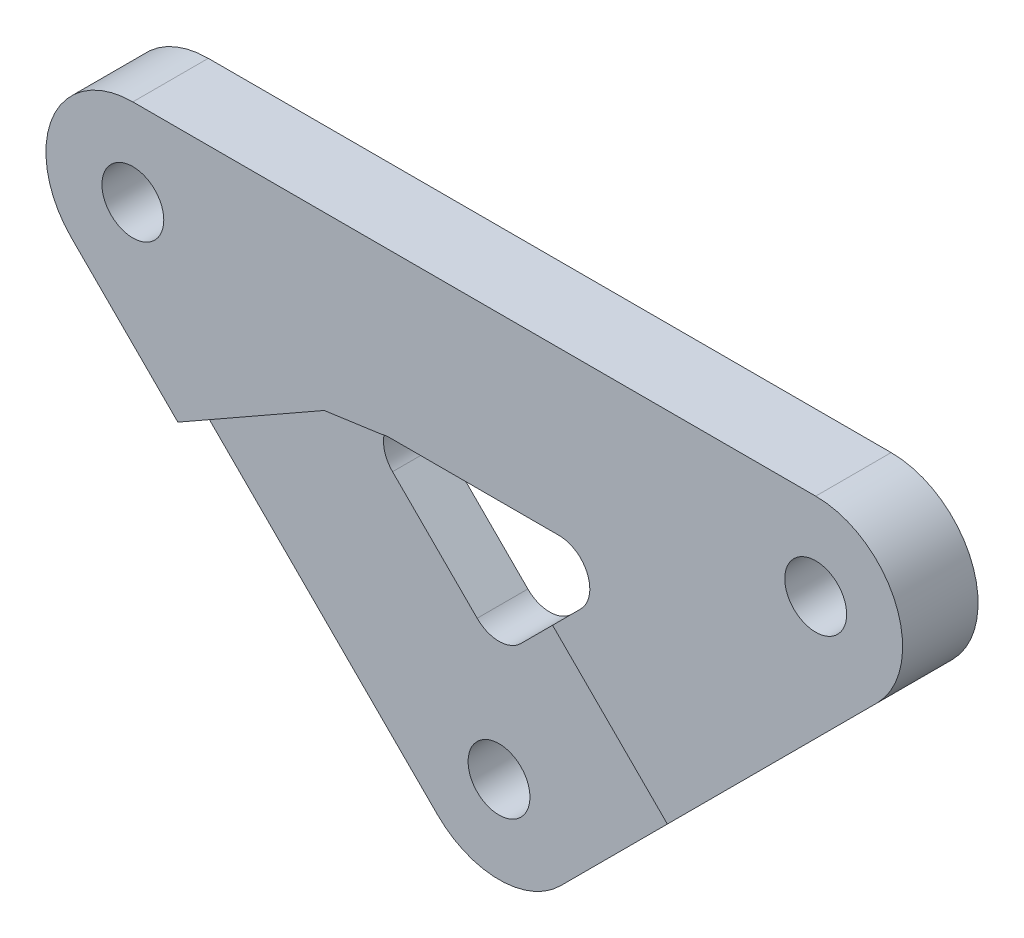
ISO-10303-21;
HEADER;
FILE_DESCRIPTION(('STEP AP214'),'2;1');
FILE_NAME('part.step','',(''),(''),'','','');
FILE_SCHEMA(('AUTOMOTIVE_DESIGN { 1 0 10303 214 1 1 1 1 }'));
ENDSEC;
DATA;
#1=APPLICATION_CONTEXT('core data for automotive mechanical design processes');
#2=APPLICATION_PROTOCOL_DEFINITION('international standard','automotive_design',2000,#1);
#3=PRODUCT_CONTEXT('',#1,'mechanical');
#4=PRODUCT('Part','Part','',(#3));
#5=PRODUCT_RELATED_PRODUCT_CATEGORY('part','',(#4));
#6=PRODUCT_DEFINITION_FORMATION('','',#4);
#7=PRODUCT_DEFINITION_CONTEXT('part definition',#1,'design');
#8=PRODUCT_DEFINITION('design','',#6,#7);
#9=PRODUCT_DEFINITION_SHAPE('','',#8);
#10=(LENGTH_UNIT() NAMED_UNIT(*) SI_UNIT(.MILLI.,.METRE.));
#11=(NAMED_UNIT(*) PLANE_ANGLE_UNIT() SI_UNIT($,.RADIAN.));
#12=(NAMED_UNIT(*) SI_UNIT($,.STERADIAN.) SOLID_ANGLE_UNIT());
#13=UNCERTAINTY_MEASURE_WITH_UNIT(LENGTH_MEASURE(1.E-05),#10,'distance_accuracy_value','');
#14=(GEOMETRIC_REPRESENTATION_CONTEXT(3) GLOBAL_UNCERTAINTY_ASSIGNED_CONTEXT((#13)) GLOBAL_UNIT_ASSIGNED_CONTEXT((#10,
#11,#12)) REPRESENTATION_CONTEXT('',''));
#15=CARTESIAN_POINT('',(0.,0.,0.));
#16=DIRECTION('',(0.,0.,1.));
#17=DIRECTION('',(1.,0.,0.));
#18=AXIS2_PLACEMENT_3D('',#15,#16,#17);
#19=CARTESIAN_POINT('',(0.,0.,5.));
#20=DIRECTION('',(0.,0.,1.));
#21=DIRECTION('',(1.,0.,0.));
#22=AXIS2_PLACEMENT_3D('',#19,#20,#21);
#23=PLANE('',#22);
#24=DIRECTION('',(-0.707106781186548,0.707106781186547,0.));
#25=VECTOR('',#24,1.);
#26=CARTESIAN_POINT('',(5.18840179831688,12.2594696101824,5.));
#27=LINE('',#26,#25);
#28=CARTESIAN_POINT('',(12.7972664676805,4.65060494081874,5.));
#29=VERTEX_POINT('',#28);
#30=CARTESIAN_POINT('',(5.18840179831688,12.2594696101824,5.));
#31=VERTEX_POINT('',#30);
#32=EDGE_CURVE('E162',#29,#31,#27,.T.);
#33=ORIENTED_EDGE('',*,*,#32,.F.);
#34=DIRECTION('',(0.707106781186547,0.707106781186547,0.));
#35=VECTOR('',#34,1.);
#36=CARTESIAN_POINT('',(4.07333076343086,-4.07333076343089,5.));
#37=LINE('',#36,#35);
#38=CARTESIAN_POINT('',(26.7007477614004,18.5540862345386,5.));
#39=VERTEX_POINT('',#38);
#40=EDGE_CURVE('E261',#29,#39,#37,.T.);
#41=ORIENTED_EDGE('',*,*,#40,.T.);
#42=CARTESIAN_POINT('',(22.6274169979695,22.6274169979695,5.));
#43=DIRECTION('',(0.,0.,1.));
#44=DIRECTION('',(-1.,0.,0.));
#45=AXIS2_PLACEMENT_3D('',#42,#43,#44);
#46=CIRCLE('',#45,5.7605596096755);
#47=CARTESIAN_POINT('',(22.6274169979695,28.387976607645,5.));
#48=VERTEX_POINT('',#47);
#49=EDGE_CURVE('E263',#39,#48,#46,.T.);
#50=ORIENTED_EDGE('',*,*,#49,.T.);
#51=DIRECTION('',(-1.,0.,0.));
#52=VECTOR('',#51,1.);
#53=CARTESIAN_POINT('',(22.6274169979695,28.387976607645,5.));
#54=LINE('',#53,#52);
#55=CARTESIAN_POINT('',(-22.6274169979695,28.387976607645,5.));
#56=VERTEX_POINT('',#55);
#57=EDGE_CURVE('E266',#48,#56,#54,.T.);
#58=ORIENTED_EDGE('',*,*,#57,.T.);
#59=CARTESIAN_POINT('',(-22.6274169979695,22.6274169979695,5.));
#60=DIRECTION('',(0.,0.,1.));
#61=DIRECTION('',(-1.,0.,0.));
#62=AXIS2_PLACEMENT_3D('',#59,#60,#61);
#63=CIRCLE('',#62,5.7605596096755);
#64=CARTESIAN_POINT('',(-26.7007477614004,18.5540862345386,5.));
#65=VERTEX_POINT('',#64);
#66=EDGE_CURVE('E268',#56,#65,#63,.T.);
#67=ORIENTED_EDGE('',*,*,#66,.T.);
#68=DIRECTION('',(0.707106781186548,-0.707106781186547,0.));
#69=VECTOR('',#68,1.);
#70=CARTESIAN_POINT('',(-26.7007477614004,18.5540862345386,5.));
#71=LINE('',#70,#69);
#72=CARTESIAN_POINT('',(-19.6438151370129,11.4971536101511,5.));
#73=VERTEX_POINT('',#72);
#74=EDGE_CURVE('E270',#65,#73,#71,.T.);
#75=ORIENTED_EDGE('',*,*,#74,.T.);
#76=DIRECTION('',(-0.869059872634388,-0.49470692109238,0.));
#77=VECTOR('',#76,1.);
#78=CARTESIAN_POINT('',(-19.6438151370129,11.4971536101511,5.));
#79=LINE('',#78,#77);
#80=CARTESIAN_POINT('',(-9.94632288120085,17.0173906930663,5.));
#81=VERTEX_POINT('',#80);
#82=EDGE_CURVE('E172',#81,#73,#79,.T.);
#83=ORIENTED_EDGE('',*,*,#82,.F.);
#84=DIRECTION('',(-0.990261652823926,-0.139218744953497,0.));
#85=VECTOR('',#84,1.);
#86=CARTESIAN_POINT('',(-9.94632288120085,17.0173906930663,5.));
#87=LINE('',#86,#85);
#88=CARTESIAN_POINT('',(-6.17244961961426,17.5479513762892,5.));
#89=VERTEX_POINT('',#88);
#90=EDGE_CURVE('E189',#89,#81,#87,.T.);
#91=ORIENTED_EDGE('',*,*,#90,.F.);
#92=CARTESIAN_POINT('',(-5.6072113832392,15.5774169979695,5.));
#93=DIRECTION('',(0.,0.,1.));
#94=DIRECTION('',(1.,0.,0.));
#95=AXIS2_PLACEMENT_3D('',#92,#93,#94);
#96=CIRCLE('',#95,2.05);
#97=CARTESIAN_POINT('',(-5.6072113832392,17.6274169979695,5.));
#98=VERTEX_POINT('',#97);
#99=EDGE_CURVE('E228',#98,#89,#96,.T.);
#100=ORIENTED_EDGE('',*,*,#99,.F.);
#101=DIRECTION('',(-1.,0.,0.));
#102=VECTOR('',#101,1.);
#103=CARTESIAN_POINT('',(5.6072113832392,17.6274169979695,5.));
#104=LINE('',#103,#102);
#105=CARTESIAN_POINT('',(5.6072113832392,17.6274169979695,5.));
#106=VERTEX_POINT('',#105);
#107=EDGE_CURVE('E226',#106,#98,#104,.T.);
#108=ORIENTED_EDGE('',*,*,#107,.F.);
#109=CARTESIAN_POINT('',(5.6072113832392,15.5774169979695,5.));
#110=DIRECTION('',(0.,0.,1.));
#111=DIRECTION('',(-1.,0.,0.));
#112=AXIS2_PLACEMENT_3D('',#109,#110,#111);
#113=CIRCLE('',#112,2.05);
#114=CARTESIAN_POINT('',(7.05678028467162,14.1278480965371,5.));
#115=VERTEX_POINT('',#114);
#116=EDGE_CURVE('E223',#115,#106,#113,.T.);
#117=ORIENTED_EDGE('',*,*,#116,.F.);
#118=DIRECTION('',(0.707106781186547,0.707106781186548,0.));
#119=VECTOR('',#118,1.);
#120=CARTESIAN_POINT('',(1.44956890143242,8.5206367132979,5.));
#121=LINE('',#120,#119);
#122=EDGE_CURVE('E221',#31,#115,#121,.T.);
#123=ORIENTED_EDGE('',*,*,#122,.F.);
#124=EDGE_LOOP('',(#33,#41,#50,#58,#67,#75,#83,#91,#100,#108,#117,#123));
#125=FACE_BOUND('',#124,.T.);
#126=CARTESIAN_POINT('',(22.6274169979695,22.6274169979695,5.));
#127=DIRECTION('',(0.,0.,1.));
#128=DIRECTION('',(1.,0.,0.));
#129=AXIS2_PLACEMENT_3D('',#126,#127,#128);
#130=CIRCLE('',#129,2.05);
#131=CARTESIAN_POINT('',(24.6774169979695,22.6274169979695,5.));
#132=VERTEX_POINT('',#131);
#133=EDGE_CURVE('E215',#132,#132,#130,.T.);
#134=ORIENTED_EDGE('',*,*,#133,.F.);
#135=EDGE_LOOP('',(#134));
#136=FACE_BOUND('',#135,.T.);
#137=CARTESIAN_POINT('',(-22.6274169979695,22.6274169979695,5.));
#138=DIRECTION('',(0.,0.,1.));
#139=DIRECTION('',(1.,0.,0.));
#140=AXIS2_PLACEMENT_3D('',#137,#138,#139);
#141=CIRCLE('',#140,2.05);
#142=CARTESIAN_POINT('',(-20.5774169979695,22.6274169979695,5.));
#143=VERTEX_POINT('',#142);
#144=EDGE_CURVE('E209',#143,#143,#141,.T.);
#145=ORIENTED_EDGE('',*,*,#144,.F.);
#146=EDGE_LOOP('',(#145));
#147=FACE_BOUND('',#146,.T.);
#148=ADVANCED_FACE('F37',(#125,#136,#147),#23,.T.);
#149=CARTESIAN_POINT('',(0.,0.,0.));
#150=DIRECTION('',(0.,0.,1.));
#151=DIRECTION('',(1.,0.,0.));
#152=AXIS2_PLACEMENT_3D('',#149,#150,#151);
#153=PLANE('',#152);
#154=CARTESIAN_POINT('',(0.,0.,0.));
#155=DIRECTION('',(0.,0.,1.));
#156=DIRECTION('',(1.,0.,0.));
#157=AXIS2_PLACEMENT_3D('',#154,#155,#156);
#158=CIRCLE('',#157,2.05);
#159=CARTESIAN_POINT('',(2.04999999999999,0.,0.));
#160=VERTEX_POINT('',#159);
#161=EDGE_CURVE('E257',#160,#160,#158,.T.);
#162=ORIENTED_EDGE('',*,*,#161,.T.);
#163=EDGE_LOOP('',(#162));
#164=FACE_BOUND('',#163,.T.);
#165=CARTESIAN_POINT('',(0.,0.,0.));
#166=DIRECTION('',(0.,0.,1.));
#167=DIRECTION('',(1.,0.,0.));
#168=AXIS2_PLACEMENT_3D('',#165,#166,#167);
#169=CIRCLE('',#168,5.7605596096755);
#170=CARTESIAN_POINT('',(-4.07333076343089,-4.07333076343089,0.));
#171=VERTEX_POINT('',#170);
#172=CARTESIAN_POINT('',(4.07333076343086,-4.07333076343089,0.));
#173=VERTEX_POINT('',#172);
#174=EDGE_CURVE('E260',#171,#173,#169,.T.);
#175=ORIENTED_EDGE('',*,*,#174,.F.);
#176=DIRECTION('',(0.707106781186548,-0.707106781186547,0.));
#177=VECTOR('',#176,1.);
#178=CARTESIAN_POINT('',(-26.7007477614004,18.5540862345386,0.));
#179=LINE('',#178,#177);
#180=CARTESIAN_POINT('',(-26.7007477614004,18.5540862345386,0.));
#181=VERTEX_POINT('',#180);
#182=EDGE_CURVE('E264',#181,#171,#179,.T.);
#183=ORIENTED_EDGE('',*,*,#182,.F.);
#184=CARTESIAN_POINT('',(-22.6274169979695,22.6274169979695,0.));
#185=DIRECTION('',(0.,0.,1.));
#186=DIRECTION('',(-1.,0.,0.));
#187=AXIS2_PLACEMENT_3D('',#184,#185,#186);
#188=CIRCLE('',#187,5.7605596096755);
#189=CARTESIAN_POINT('',(-22.6274169979695,28.387976607645,0.));
#190=VERTEX_POINT('',#189);
#191=EDGE_CURVE('E282',#190,#181,#188,.T.);
#192=ORIENTED_EDGE('',*,*,#191,.F.);
#193=DIRECTION('',(-1.,0.,0.));
#194=VECTOR('',#193,1.);
#195=CARTESIAN_POINT('',(22.6274169979695,28.387976607645,0.));
#196=LINE('',#195,#194);
#197=CARTESIAN_POINT('',(22.6274169979695,28.387976607645,0.));
#198=VERTEX_POINT('',#197);
#199=EDGE_CURVE('E280',#198,#190,#196,.T.);
#200=ORIENTED_EDGE('',*,*,#199,.F.);
#201=CARTESIAN_POINT('',(22.6274169979695,22.6274169979695,0.));
#202=DIRECTION('',(0.,0.,1.));
#203=DIRECTION('',(-1.,0.,0.));
#204=AXIS2_PLACEMENT_3D('',#201,#202,#203);
#205=CIRCLE('',#204,5.7605596096755);
#206=CARTESIAN_POINT('',(26.7007477614004,18.5540862345386,0.));
#207=VERTEX_POINT('',#206);
#208=EDGE_CURVE('E278',#207,#198,#205,.T.);
#209=ORIENTED_EDGE('',*,*,#208,.F.);
#210=DIRECTION('',(0.707106781186547,0.707106781186547,0.));
#211=VECTOR('',#210,1.);
#212=CARTESIAN_POINT('',(4.07333076343086,-4.07333076343089,0.));
#213=LINE('',#212,#211);
#214=EDGE_CURVE('E276',#173,#207,#213,.T.);
#215=ORIENTED_EDGE('',*,*,#214,.F.);
#216=EDGE_LOOP('',(#175,#183,#192,#200,#209,#215));
#217=FACE_BOUND('',#216,.T.);
#218=CARTESIAN_POINT('',(0.,9.97020561473033,0.));
#219=DIRECTION('',(0.,0.,1.));
#220=DIRECTION('',(1.,0.,0.));
#221=AXIS2_PLACEMENT_3D('',#218,#219,#220);
#222=CIRCLE('',#221,2.05);
#223=CARTESIAN_POINT('',(-1.44956890143242,8.52063671329791,0.));
#224=VERTEX_POINT('',#223);
#225=CARTESIAN_POINT('',(1.44956890143242,8.5206367132979,0.));
#226=VERTEX_POINT('',#225);
#227=EDGE_CURVE('E218',#224,#226,#222,.T.);
#228=ORIENTED_EDGE('',*,*,#227,.T.);
#229=DIRECTION('',(0.707106781186547,0.707106781186548,0.));
#230=VECTOR('',#229,1.);
#231=CARTESIAN_POINT('',(1.44956890143242,8.5206367132979,0.));
#232=LINE('',#231,#230);
#233=CARTESIAN_POINT('',(7.05678028467162,14.1278480965371,0.));
#234=VERTEX_POINT('',#233);
#235=EDGE_CURVE('E233',#226,#234,#232,.T.);
#236=ORIENTED_EDGE('',*,*,#235,.T.);
#237=CARTESIAN_POINT('',(5.6072113832392,15.5774169979695,0.));
#238=DIRECTION('',(0.,0.,1.));
#239=DIRECTION('',(-1.,0.,0.));
#240=AXIS2_PLACEMENT_3D('',#237,#238,#239);
#241=CIRCLE('',#240,2.05);
#242=CARTESIAN_POINT('',(5.6072113832392,17.6274169979695,0.));
#243=VERTEX_POINT('',#242);
#244=EDGE_CURVE('E236',#234,#243,#241,.T.);
#245=ORIENTED_EDGE('',*,*,#244,.T.);
#246=DIRECTION('',(-1.,0.,0.));
#247=VECTOR('',#246,1.);
#248=CARTESIAN_POINT('',(5.6072113832392,17.6274169979695,0.));
#249=LINE('',#248,#247);
#250=CARTESIAN_POINT('',(-5.6072113832392,17.6274169979695,0.));
#251=VERTEX_POINT('',#250);
#252=EDGE_CURVE('E239',#243,#251,#249,.T.);
#253=ORIENTED_EDGE('',*,*,#252,.T.);
#254=CARTESIAN_POINT('',(-5.6072113832392,15.5774169979695,0.));
#255=DIRECTION('',(0.,0.,1.));
#256=DIRECTION('',(1.,0.,0.));
#257=AXIS2_PLACEMENT_3D('',#254,#255,#256);
#258=CIRCLE('',#257,2.05);
#259=CARTESIAN_POINT('',(-7.05678028467162,14.1278480965371,0.));
#260=VERTEX_POINT('',#259);
#261=EDGE_CURVE('E242',#251,#260,#258,.T.);
#262=ORIENTED_EDGE('',*,*,#261,.T.);
#263=DIRECTION('',(0.707106781186547,-0.707106781186548,0.));
#264=VECTOR('',#263,1.);
#265=CARTESIAN_POINT('',(-7.05678028467162,14.1278480965371,0.));
#266=LINE('',#265,#264);
#267=EDGE_CURVE('E224',#260,#224,#266,.T.);
#268=ORIENTED_EDGE('',*,*,#267,.T.);
#269=EDGE_LOOP('',(#228,#236,#245,#253,#262,#268));
#270=FACE_BOUND('',#269,.T.);
#271=CARTESIAN_POINT('',(22.6274169979695,22.6274169979695,0.));
#272=DIRECTION('',(0.,0.,1.));
#273=DIRECTION('',(1.,0.,0.));
#274=AXIS2_PLACEMENT_3D('',#271,#272,#273);
#275=CIRCLE('',#274,2.05);
#276=CARTESIAN_POINT('',(24.6774169979695,22.6274169979695,0.));
#277=VERTEX_POINT('',#276);
#278=EDGE_CURVE('E212',#277,#277,#275,.T.);
#279=ORIENTED_EDGE('',*,*,#278,.T.);
#280=EDGE_LOOP('',(#279));
#281=FACE_BOUND('',#280,.T.);
#282=CARTESIAN_POINT('',(-22.6274169979695,22.6274169979695,0.));
#283=DIRECTION('',(0.,0.,1.));
#284=DIRECTION('',(1.,0.,0.));
#285=AXIS2_PLACEMENT_3D('',#282,#283,#284);
#286=CIRCLE('',#285,2.05);
#287=CARTESIAN_POINT('',(-20.5774169979695,22.6274169979695,0.));
#288=VERTEX_POINT('',#287);
#289=EDGE_CURVE('E208',#288,#288,#286,.T.);
#290=ORIENTED_EDGE('',*,*,#289,.T.);
#291=EDGE_LOOP('',(#290));
#292=FACE_BOUND('',#291,.T.);
#293=ADVANCED_FACE('F309',(#164,#217,#270,#281,#292),#153,.F.);
#294=CARTESIAN_POINT('',(0.,0.,5.));
#295=DIRECTION('',(0.,0.,-1.));
#296=DIRECTION('',(-1.,0.,0.));
#297=AXIS2_PLACEMENT_3D('',#294,#295,#296);
#298=CYLINDRICAL_SURFACE('',#297,5.7605596096755);
#299=DIRECTION('',(0.,0.,-1.));
#300=VECTOR('',#299,1.);
#301=CARTESIAN_POINT('',(4.07333076343086,-4.07333076343089,5.));
#302=LINE('',#301,#300);
#303=CARTESIAN_POINT('',(4.07333076343087,-4.07333076343089,3.36));
#304=VERTEX_POINT('',#303);
#305=EDGE_CURVE('E299',#304,#173,#302,.T.);
#306=ORIENTED_EDGE('',*,*,#305,.F.);
#307=CARTESIAN_POINT('',(0.,0.,3.36));
#308=DIRECTION('',(0.,0.,-1.));
#309=DIRECTION('',(-1.,0.,0.));
#310=AXIS2_PLACEMENT_3D('',#307,#308,#309);
#311=CIRCLE('',#310,5.7605596096755);
#312=CARTESIAN_POINT('',(-4.07333076343089,-4.07333076343089,3.36));
#313=VERTEX_POINT('',#312);
#314=EDGE_CURVE('E205',#304,#313,#311,.T.);
#315=ORIENTED_EDGE('',*,*,#314,.T.);
#316=DIRECTION('',(0.,0.,-1.));
#317=VECTOR('',#316,1.);
#318=CARTESIAN_POINT('',(-4.07333076343089,-4.07333076343089,5.));
#319=LINE('',#318,#317);
#320=EDGE_CURVE('E273',#313,#171,#319,.T.);
#321=ORIENTED_EDGE('',*,*,#320,.T.);
#322=ORIENTED_EDGE('',*,*,#174,.T.);
#323=EDGE_LOOP('',(#306,#315,#321,#322));
#324=FACE_BOUND('',#323,.T.);
#325=ADVANCED_FACE('F39',(#324),#298,.T.);
#326=CARTESIAN_POINT('',(4.07333076343086,-4.07333076343089,5.));
#327=DIRECTION('',(-0.707106781186548,0.707106781186548,0.));
#328=DIRECTION('',(-0.707106781186548,-0.707106781186548,0.));
#329=AXIS2_PLACEMENT_3D('',#326,#327,#328);
#330=PLANE('',#329);
#331=ORIENTED_EDGE('',*,*,#40,.F.);
#332=DIRECTION('',(0.,0.,1.));
#333=VECTOR('',#332,1.);
#334=CARTESIAN_POINT('',(12.7972664676805,4.65060494081874,3.36));
#335=LINE('',#334,#333);
#336=CARTESIAN_POINT('',(12.7972664676805,4.65060494081874,3.36));
#337=VERTEX_POINT('',#336);
#338=EDGE_CURVE('E192',#337,#29,#335,.T.);
#339=ORIENTED_EDGE('',*,*,#338,.F.);
#340=DIRECTION('',(0.707106781186547,0.707106781186548,0.));
#341=VECTOR('',#340,1.);
#342=CARTESIAN_POINT('',(12.7972664676805,4.65060494081874,3.36));
#343=LINE('',#342,#341);
#344=EDGE_CURVE('E167',#304,#337,#343,.T.);
#345=ORIENTED_EDGE('',*,*,#344,.F.);
#346=ORIENTED_EDGE('',*,*,#305,.T.);
#347=ORIENTED_EDGE('',*,*,#214,.T.);
#348=DIRECTION('',(0.,0.,-1.));
#349=VECTOR('',#348,1.);
#350=CARTESIAN_POINT('',(26.7007477614004,18.5540862345386,5.));
#351=LINE('',#350,#349);
#352=EDGE_CURVE('E296',#39,#207,#351,.T.);
#353=ORIENTED_EDGE('',*,*,#352,.F.);
#354=EDGE_LOOP('',(#331,#339,#345,#346,#347,#353));
#355=FACE_BOUND('',#354,.T.);
#356=ADVANCED_FACE('F338',(#355),#330,.F.);
#357=CARTESIAN_POINT('',(22.6274169979695,22.6274169979695,5.));
#358=DIRECTION('',(0.,0.,-1.));
#359=DIRECTION('',(-1.,0.,0.));
#360=AXIS2_PLACEMENT_3D('',#357,#358,#359);
#361=CYLINDRICAL_SURFACE('',#360,5.7605596096755);
#362=ORIENTED_EDGE('',*,*,#208,.T.);
#363=DIRECTION('',(0.,0.,-1.));
#364=VECTOR('',#363,1.);
#365=CARTESIAN_POINT('',(22.6274169979695,28.387976607645,5.));
#366=LINE('',#365,#364);
#367=EDGE_CURVE('E293',#48,#198,#366,.T.);
#368=ORIENTED_EDGE('',*,*,#367,.F.);
#369=ORIENTED_EDGE('',*,*,#49,.F.);
#370=ORIENTED_EDGE('',*,*,#352,.T.);
#371=EDGE_LOOP('',(#362,#368,#369,#370));
#372=FACE_BOUND('',#371,.T.);
#373=ADVANCED_FACE('F375',(#372),#361,.T.);
#374=CARTESIAN_POINT('',(22.6274169979695,28.387976607645,5.));
#375=DIRECTION('',(0.,-1.,0.));
#376=DIRECTION('',(1.,0.,0.));
#377=AXIS2_PLACEMENT_3D('',#374,#375,#376);
#378=PLANE('',#377);
#379=ORIENTED_EDGE('',*,*,#199,.T.);
#380=DIRECTION('',(0.,0.,-1.));
#381=VECTOR('',#380,1.);
#382=CARTESIAN_POINT('',(-22.6274169979695,28.387976607645,5.));
#383=LINE('',#382,#381);
#384=EDGE_CURVE('E290',#56,#190,#383,.T.);
#385=ORIENTED_EDGE('',*,*,#384,.F.);
#386=ORIENTED_EDGE('',*,*,#57,.F.);
#387=ORIENTED_EDGE('',*,*,#367,.T.);
#388=EDGE_LOOP('',(#379,#385,#386,#387));
#389=FACE_BOUND('',#388,.T.);
#390=ADVANCED_FACE('F371',(#389),#378,.F.);
#391=CARTESIAN_POINT('',(-22.6274169979695,22.6274169979695,5.));
#392=DIRECTION('',(0.,0.,-1.));
#393=DIRECTION('',(-1.,0.,0.));
#394=AXIS2_PLACEMENT_3D('',#391,#392,#393);
#395=CYLINDRICAL_SURFACE('',#394,5.7605596096755);
#396=ORIENTED_EDGE('',*,*,#191,.T.);
#397=DIRECTION('',(0.,0.,-1.));
#398=VECTOR('',#397,1.);
#399=CARTESIAN_POINT('',(-26.7007477614004,18.5540862345386,5.));
#400=LINE('',#399,#398);
#401=EDGE_CURVE('E287',#65,#181,#400,.T.);
#402=ORIENTED_EDGE('',*,*,#401,.F.);
#403=ORIENTED_EDGE('',*,*,#66,.F.);
#404=ORIENTED_EDGE('',*,*,#384,.T.);
#405=EDGE_LOOP('',(#396,#402,#403,#404));
#406=FACE_BOUND('',#405,.T.);
#407=ADVANCED_FACE('F368',(#406),#395,.T.);
#408=CARTESIAN_POINT('',(-26.7007477614004,18.5540862345386,5.));
#409=DIRECTION('',(0.707106781186547,0.707106781186548,0.));
#410=DIRECTION('',(-0.707106781186548,0.707106781186547,0.));
#411=AXIS2_PLACEMENT_3D('',#408,#409,#410);
#412=PLANE('',#411);
#413=DIRECTION('',(0.707106781186548,-0.707106781186548,0.));
#414=VECTOR('',#413,1.);
#415=CARTESIAN_POINT('',(0.,-8.14666152686177,3.36));
#416=LINE('',#415,#414);
#417=CARTESIAN_POINT('',(-19.6438151370129,11.4971536101511,3.36));
#418=VERTEX_POINT('',#417);
#419=EDGE_CURVE('E185',#418,#313,#416,.T.);
#420=ORIENTED_EDGE('',*,*,#419,.F.);
#421=DIRECTION('',(0.,0.,1.));
#422=VECTOR('',#421,1.);
#423=CARTESIAN_POINT('',(-19.6438151370129,11.4971536101511,3.36));
#424=LINE('',#423,#422);
#425=EDGE_CURVE('E195',#418,#73,#424,.T.);
#426=ORIENTED_EDGE('',*,*,#425,.T.);
#427=ORIENTED_EDGE('',*,*,#74,.F.);
#428=ORIENTED_EDGE('',*,*,#401,.T.);
#429=ORIENTED_EDGE('',*,*,#182,.T.);
#430=ORIENTED_EDGE('',*,*,#320,.F.);
#431=EDGE_LOOP('',(#420,#426,#427,#428,#429,#430));
#432=FACE_BOUND('',#431,.T.);
#433=ADVANCED_FACE('F330',(#432),#412,.F.);
#434=CARTESIAN_POINT('',(0.,0.,5.));
#435=DIRECTION('',(0.,0.,-1.));
#436=DIRECTION('',(-1.,0.,0.));
#437=AXIS2_PLACEMENT_3D('',#434,#435,#436);
#438=CYLINDRICAL_SURFACE('',#437,2.05);
#439=CARTESIAN_POINT('',(0.,0.,3.36));
#440=DIRECTION('',(0.,0.,-1.));
#441=DIRECTION('',(-1.,0.,0.));
#442=AXIS2_PLACEMENT_3D('',#439,#440,#441);
#443=CIRCLE('',#442,2.05);
#444=CARTESIAN_POINT('',(-2.05000000000001,0.,3.36));
#445=VERTEX_POINT('',#444);
#446=EDGE_CURVE('E202',#445,#445,#443,.T.);
#447=ORIENTED_EDGE('',*,*,#446,.F.);
#448=EDGE_LOOP('',(#447));
#449=FACE_BOUND('',#448,.T.);
#450=ORIENTED_EDGE('',*,*,#161,.F.);
#451=EDGE_LOOP('',(#450));
#452=FACE_BOUND('',#451,.T.);
#453=ADVANCED_FACE('F349',(#449,#452),#438,.F.);
#454=CARTESIAN_POINT('',(0.,9.97020561473033,5.));
#455=DIRECTION('',(0.,0.,-1.));
#456=DIRECTION('',(-1.,0.,0.));
#457=AXIS2_PLACEMENT_3D('',#454,#455,#456);
#458=CYLINDRICAL_SURFACE('',#457,2.05);
#459=CARTESIAN_POINT('',(0.,9.97020561473033,3.36));
#460=DIRECTION('',(0.,0.,-1.));
#461=DIRECTION('',(-1.,0.,0.));
#462=AXIS2_PLACEMENT_3D('',#459,#460,#461);
#463=CIRCLE('',#462,2.05);
#464=CARTESIAN_POINT('',(1.44956890143242,8.5206367132979,3.36));
#465=VERTEX_POINT('',#464);
#466=CARTESIAN_POINT('',(-1.44956890143242,8.5206367132979,3.36));
#467=VERTEX_POINT('',#466);
#468=EDGE_CURVE('E52',#465,#467,#463,.T.);
#469=ORIENTED_EDGE('',*,*,#468,.F.);
#470=DIRECTION('',(0.,0.,-1.));
#471=VECTOR('',#470,1.);
#472=CARTESIAN_POINT('',(1.44956890143242,8.5206367132979,5.));
#473=LINE('',#472,#471);
#474=EDGE_CURVE('E177',#465,#226,#473,.T.);
#475=ORIENTED_EDGE('',*,*,#474,.T.);
#476=ORIENTED_EDGE('',*,*,#227,.F.);
#477=DIRECTION('',(0.,0.,-1.));
#478=VECTOR('',#477,1.);
#479=CARTESIAN_POINT('',(-1.44956890143242,8.5206367132979,5.));
#480=LINE('',#479,#478);
#481=EDGE_CURVE('E59',#467,#224,#480,.T.);
#482=ORIENTED_EDGE('',*,*,#481,.F.);
#483=EDGE_LOOP('',(#469,#475,#476,#482));
#484=FACE_BOUND('',#483,.T.);
#485=ADVANCED_FACE('F347',(#484),#458,.F.);
#486=CARTESIAN_POINT('',(1.44956890143242,8.5206367132979,5.));
#487=DIRECTION('',(-0.707106781186548,0.707106781186547,0.));
#488=DIRECTION('',(-0.707106781186547,-0.707106781186548,0.));
#489=AXIS2_PLACEMENT_3D('',#486,#487,#488);
#490=PLANE('',#489);
#491=DIRECTION('',(0.,0.,1.));
#492=VECTOR('',#491,1.);
#493=CARTESIAN_POINT('',(5.18840179831688,12.2594696101824,3.36));
#494=LINE('',#493,#492);
#495=CARTESIAN_POINT('',(5.18840179831688,12.2594696101824,3.36));
#496=VERTEX_POINT('',#495);
#497=EDGE_CURVE('E156',#496,#31,#494,.T.);
#498=ORIENTED_EDGE('',*,*,#497,.T.);
#499=ORIENTED_EDGE('',*,*,#122,.T.);
#500=DIRECTION('',(0.,0.,-1.));
#501=VECTOR('',#500,1.);
#502=CARTESIAN_POINT('',(7.05678028467162,14.1278480965371,5.));
#503=LINE('',#502,#501);
#504=EDGE_CURVE('E254',#115,#234,#503,.T.);
#505=ORIENTED_EDGE('',*,*,#504,.T.);
#506=ORIENTED_EDGE('',*,*,#235,.F.);
#507=ORIENTED_EDGE('',*,*,#474,.F.);
#508=DIRECTION('',(-0.707106781186547,-0.707106781186548,0.));
#509=VECTOR('',#508,1.);
#510=CARTESIAN_POINT('',(1.44956890143242,8.5206367132979,3.36));
#511=LINE('',#510,#509);
#512=EDGE_CURVE('E170',#496,#465,#511,.T.);
#513=ORIENTED_EDGE('',*,*,#512,.F.);
#514=EDGE_LOOP('',(#498,#499,#505,#506,#507,#513));
#515=FACE_BOUND('',#514,.T.);
#516=ADVANCED_FACE('F175',(#515),#490,.T.);
#517=CARTESIAN_POINT('',(5.6072113832392,15.5774169979695,5.));
#518=DIRECTION('',(0.,0.,-1.));
#519=DIRECTION('',(-1.,0.,0.));
#520=AXIS2_PLACEMENT_3D('',#517,#518,#519);
#521=CYLINDRICAL_SURFACE('',#520,2.05);
#522=ORIENTED_EDGE('',*,*,#244,.F.);
#523=ORIENTED_EDGE('',*,*,#504,.F.);
#524=ORIENTED_EDGE('',*,*,#116,.T.);
#525=DIRECTION('',(0.,0.,-1.));
#526=VECTOR('',#525,1.);
#527=CARTESIAN_POINT('',(5.6072113832392,17.6274169979695,5.));
#528=LINE('',#527,#526);
#529=EDGE_CURVE('E252',#106,#243,#528,.T.);
#530=ORIENTED_EDGE('',*,*,#529,.T.);
#531=EDGE_LOOP('',(#522,#523,#524,#530));
#532=FACE_BOUND('',#531,.T.);
#533=ADVANCED_FACE('F344',(#532),#521,.F.);
#534=CARTESIAN_POINT('',(5.6072113832392,17.6274169979695,5.));
#535=DIRECTION('',(0.,-1.,0.));
#536=DIRECTION('',(0.,0.,-1.));
#537=AXIS2_PLACEMENT_3D('',#534,#535,#536);
#538=PLANE('',#537);
#539=ORIENTED_EDGE('',*,*,#252,.F.);
#540=ORIENTED_EDGE('',*,*,#529,.F.);
#541=ORIENTED_EDGE('',*,*,#107,.T.);
#542=DIRECTION('',(0.,0.,-1.));
#543=VECTOR('',#542,1.);
#544=CARTESIAN_POINT('',(-5.6072113832392,17.6274169979695,5.));
#545=LINE('',#544,#543);
#546=EDGE_CURVE('E250',#98,#251,#545,.T.);
#547=ORIENTED_EDGE('',*,*,#546,.T.);
#548=EDGE_LOOP('',(#539,#540,#541,#547));
#549=FACE_BOUND('',#548,.T.);
#550=ADVANCED_FACE('F423',(#549),#538,.T.);
#551=CARTESIAN_POINT('',(-5.6072113832392,15.5774169979695,5.));
#552=DIRECTION('',(0.,0.,-1.));
#553=DIRECTION('',(-1.,0.,0.));
#554=AXIS2_PLACEMENT_3D('',#551,#552,#553);
#555=CYLINDRICAL_SURFACE('',#554,2.05);
#556=DIRECTION('',(0.,0.,-1.));
#557=VECTOR('',#556,1.);
#558=CARTESIAN_POINT('',(-6.17244961961425,17.5479513762892,5.));
#559=LINE('',#558,#557);
#560=CARTESIAN_POINT('',(-6.17244961961426,17.5479513762892,3.36));
#561=VERTEX_POINT('',#560);
#562=EDGE_CURVE('E11',#561,#89,#559,.F.);
#563=ORIENTED_EDGE('',*,*,#562,.F.);
#564=CARTESIAN_POINT('',(-5.6072113832392,15.5774169979695,3.36));
#565=DIRECTION('',(0.,0.,-1.));
#566=DIRECTION('',(-1.,0.,0.));
#567=AXIS2_PLACEMENT_3D('',#564,#565,#566);
#568=CIRCLE('',#567,2.05);
#569=CARTESIAN_POINT('',(-7.05678028467162,14.1278480965371,3.36));
#570=VERTEX_POINT('',#569);
#571=EDGE_CURVE('E194',#570,#561,#568,.T.);
#572=ORIENTED_EDGE('',*,*,#571,.F.);
#573=DIRECTION('',(0.,0.,-1.));
#574=VECTOR('',#573,1.);
#575=CARTESIAN_POINT('',(-7.05678028467162,14.1278480965371,5.));
#576=LINE('',#575,#574);
#577=EDGE_CURVE('E248',#570,#260,#576,.T.);
#578=ORIENTED_EDGE('',*,*,#577,.T.);
#579=ORIENTED_EDGE('',*,*,#261,.F.);
#580=ORIENTED_EDGE('',*,*,#546,.F.);
#581=ORIENTED_EDGE('',*,*,#99,.T.);
#582=EDGE_LOOP('',(#563,#572,#578,#579,#580,#581));
#583=FACE_BOUND('',#582,.T.);
#584=ADVANCED_FACE('F305',(#583),#555,.F.);
#585=CARTESIAN_POINT('',(-7.05678028467162,14.1278480965371,5.));
#586=DIRECTION('',(0.707106781186548,0.707106781186547,0.));
#587=DIRECTION('',(-0.707106781186547,0.707106781186548,0.));
#588=AXIS2_PLACEMENT_3D('',#585,#586,#587);
#589=PLANE('',#588);
#590=DIRECTION('',(-0.707106781186547,0.707106781186548,0.));
#591=VECTOR('',#590,1.);
#592=CARTESIAN_POINT('',(-7.05678028467162,14.1278480965371,3.36));
#593=LINE('',#592,#591);
#594=EDGE_CURVE('E45',#467,#570,#593,.T.);
#595=ORIENTED_EDGE('',*,*,#594,.F.);
#596=ORIENTED_EDGE('',*,*,#481,.T.);
#597=ORIENTED_EDGE('',*,*,#267,.F.);
#598=ORIENTED_EDGE('',*,*,#577,.F.);
#599=EDGE_LOOP('',(#595,#596,#597,#598));
#600=FACE_BOUND('',#599,.T.);
#601=ADVANCED_FACE('F307',(#600),#589,.T.);
#602=CARTESIAN_POINT('',(22.6274169979695,22.6274169979695,5.));
#603=DIRECTION('',(0.,0.,-1.));
#604=DIRECTION('',(-1.,0.,0.));
#605=AXIS2_PLACEMENT_3D('',#602,#603,#604);
#606=CYLINDRICAL_SURFACE('',#605,2.05);
#607=ORIENTED_EDGE('',*,*,#133,.T.);
#608=EDGE_LOOP('',(#607));
#609=FACE_BOUND('',#608,.T.);
#610=ORIENTED_EDGE('',*,*,#278,.F.);
#611=EDGE_LOOP('',(#610));
#612=FACE_BOUND('',#611,.T.);
#613=ADVANCED_FACE('F432',(#609,#612),#606,.F.);
#614=CARTESIAN_POINT('',(-22.6274169979695,22.6274169979695,5.));
#615=DIRECTION('',(0.,0.,-1.));
#616=DIRECTION('',(-1.,0.,0.));
#617=AXIS2_PLACEMENT_3D('',#614,#615,#616);
#618=CYLINDRICAL_SURFACE('',#617,2.05);
#619=ORIENTED_EDGE('',*,*,#144,.T.);
#620=EDGE_LOOP('',(#619));
#621=FACE_BOUND('',#620,.T.);
#622=ORIENTED_EDGE('',*,*,#289,.F.);
#623=EDGE_LOOP('',(#622));
#624=FACE_BOUND('',#623,.T.);
#625=ADVANCED_FACE('F437',(#621,#624),#618,.F.);
#626=CARTESIAN_POINT('',(0.,0.,3.36));
#627=DIRECTION('',(0.,0.,-1.));
#628=DIRECTION('',(-1.,0.,0.));
#629=AXIS2_PLACEMENT_3D('',#626,#627,#628);
#630=PLANE('',#629);
#631=ORIENTED_EDGE('',*,*,#446,.T.);
#632=EDGE_LOOP('',(#631));
#633=FACE_BOUND('',#632,.T.);
#634=ORIENTED_EDGE('',*,*,#344,.T.);
#635=DIRECTION('',(-0.707106781186548,0.707106781186547,0.));
#636=VECTOR('',#635,1.);
#637=CARTESIAN_POINT('',(5.18840179831688,12.2594696101824,3.36));
#638=LINE('',#637,#636);
#639=EDGE_CURVE('E159',#337,#496,#638,.T.);
#640=ORIENTED_EDGE('',*,*,#639,.T.);
#641=ORIENTED_EDGE('',*,*,#512,.T.);
#642=ORIENTED_EDGE('',*,*,#468,.T.);
#643=ORIENTED_EDGE('',*,*,#594,.T.);
#644=ORIENTED_EDGE('',*,*,#571,.T.);
#645=DIRECTION('',(-0.990261652823926,-0.139218744953497,0.));
#646=VECTOR('',#645,1.);
#647=CARTESIAN_POINT('',(-9.94632288120085,17.0173906930663,3.36));
#648=LINE('',#647,#646);
#649=CARTESIAN_POINT('',(-9.94632288120085,17.0173906930663,3.36));
#650=VERTEX_POINT('',#649);
#651=EDGE_CURVE('E178',#561,#650,#648,.T.);
#652=ORIENTED_EDGE('',*,*,#651,.T.);
#653=DIRECTION('',(-0.869059872634388,-0.49470692109238,0.));
#654=VECTOR('',#653,1.);
#655=CARTESIAN_POINT('',(-19.6438151370129,11.4971536101511,3.36));
#656=LINE('',#655,#654);
#657=EDGE_CURVE('E180',#650,#418,#656,.T.);
#658=ORIENTED_EDGE('',*,*,#657,.T.);
#659=ORIENTED_EDGE('',*,*,#419,.T.);
#660=ORIENTED_EDGE('',*,*,#314,.F.);
#661=EDGE_LOOP('',(#634,#640,#641,#642,#643,#644,#652,#658,#659,#660));
#662=FACE_BOUND('',#661,.T.);
#663=ADVANCED_FACE('F169',(#633,#662),#630,.F.);
#664=CARTESIAN_POINT('',(5.18840179831688,12.2594696101824,3.36));
#665=DIRECTION('',(0.707106781186547,0.707106781186548,0.));
#666=DIRECTION('',(-0.707106781186548,0.707106781186547,0.));
#667=AXIS2_PLACEMENT_3D('',#664,#665,#666);
#668=PLANE('',#667);
#669=ORIENTED_EDGE('',*,*,#32,.T.);
#670=ORIENTED_EDGE('',*,*,#497,.F.);
#671=ORIENTED_EDGE('',*,*,#639,.F.);
#672=ORIENTED_EDGE('',*,*,#338,.T.);
#673=EDGE_LOOP('',(#669,#670,#671,#672));
#674=FACE_BOUND('',#673,.T.);
#675=ADVANCED_FACE('F158',(#674),#668,.F.);
#676=CARTESIAN_POINT('',(-19.6438151370129,11.4971536101511,3.36));
#677=DIRECTION('',(-0.49470692109238,0.869059872634388,0.));
#678=DIRECTION('',(-0.869059872634388,-0.49470692109238,0.));
#679=AXIS2_PLACEMENT_3D('',#676,#677,#678);
#680=PLANE('',#679);
#681=ORIENTED_EDGE('',*,*,#82,.T.);
#682=ORIENTED_EDGE('',*,*,#425,.F.);
#683=ORIENTED_EDGE('',*,*,#657,.F.);
#684=DIRECTION('',(0.,0.,1.));
#685=VECTOR('',#684,1.);
#686=CARTESIAN_POINT('',(-9.94632288120085,17.0173906930663,3.36));
#687=LINE('',#686,#685);
#688=EDGE_CURVE('E166',#650,#81,#687,.T.);
#689=ORIENTED_EDGE('',*,*,#688,.T.);
#690=EDGE_LOOP('',(#681,#682,#683,#689));
#691=FACE_BOUND('',#690,.T.);
#692=ADVANCED_FACE('F326',(#691),#680,.F.);
#693=CARTESIAN_POINT('',(-9.94632288120085,17.0173906930663,3.36));
#694=DIRECTION('',(-0.139218744953497,0.990261652823926,0.));
#695=DIRECTION('',(-0.990261652823926,-0.139218744953497,0.));
#696=AXIS2_PLACEMENT_3D('',#693,#694,#695);
#697=PLANE('',#696);
#698=ORIENTED_EDGE('',*,*,#562,.T.);
#699=ORIENTED_EDGE('',*,*,#90,.T.);
#700=ORIENTED_EDGE('',*,*,#688,.F.);
#701=ORIENTED_EDGE('',*,*,#651,.F.);
#702=EDGE_LOOP('',(#698,#699,#700,#701));
#703=FACE_BOUND('',#702,.T.);
#704=ADVANCED_FACE('F323',(#703),#697,.F.);
#705=CLOSED_SHELL('',(#148,#293,#325,#356,#373,#390,#407,#433,#453,#485,#516,#533,#550,#584,
#601,#613,#625,#663,#675,#692,#704));
#706=MANIFOLD_SOLID_BREP('B2',#705);
#707=ADVANCED_BREP_SHAPE_REPRESENTATION('',(#18,#706),#14);
#708=SHAPE_DEFINITION_REPRESENTATION(#9,#707);
ENDSEC;
END-ISO-10303-21;
